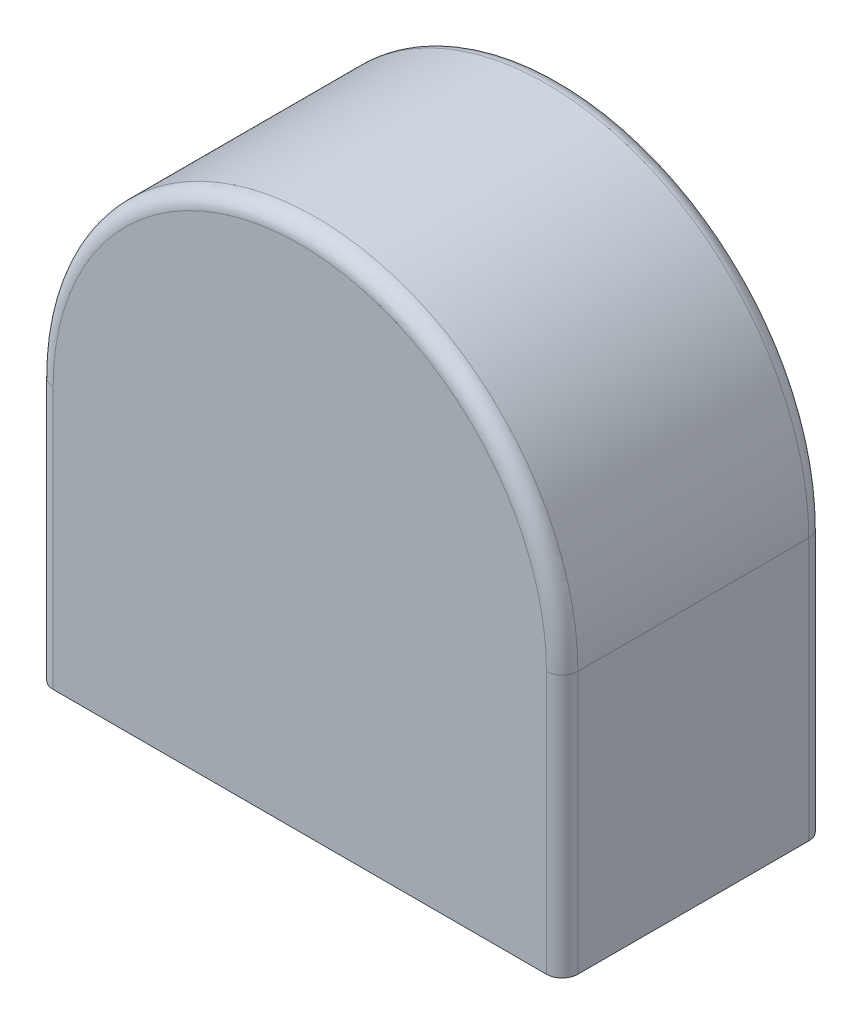
ISO-10303-21;
HEADER;
FILE_DESCRIPTION(('STEP AP214'),'2;1');
FILE_NAME('part.step','',(''),(''),'','','');
FILE_SCHEMA(('AUTOMOTIVE_DESIGN { 1 0 10303 214 1 1 1 1 }'));
ENDSEC;
DATA;
#1=APPLICATION_CONTEXT('core data for automotive mechanical design processes');
#2=APPLICATION_PROTOCOL_DEFINITION('international standard','automotive_design',2000,#1);
#3=PRODUCT_CONTEXT('',#1,'mechanical');
#4=PRODUCT('Part','Part','',(#3));
#5=PRODUCT_RELATED_PRODUCT_CATEGORY('part','',(#4));
#6=PRODUCT_DEFINITION_FORMATION('','',#4);
#7=PRODUCT_DEFINITION_CONTEXT('part definition',#1,'design');
#8=PRODUCT_DEFINITION('design','',#6,#7);
#9=PRODUCT_DEFINITION_SHAPE('','',#8);
#10=(LENGTH_UNIT() NAMED_UNIT(*) SI_UNIT(.MILLI.,.METRE.));
#11=(NAMED_UNIT(*) PLANE_ANGLE_UNIT() SI_UNIT($,.RADIAN.));
#12=(NAMED_UNIT(*) SI_UNIT($,.STERADIAN.) SOLID_ANGLE_UNIT());
#13=UNCERTAINTY_MEASURE_WITH_UNIT(LENGTH_MEASURE(1.E-05),#10,'distance_accuracy_value','');
#14=(GEOMETRIC_REPRESENTATION_CONTEXT(3) GLOBAL_UNCERTAINTY_ASSIGNED_CONTEXT((#13)) GLOBAL_UNIT_ASSIGNED_CONTEXT((#10,
#11,#12)) REPRESENTATION_CONTEXT('',''));
#15=CARTESIAN_POINT('',(0.,0.,0.));
#16=DIRECTION('',(0.,0.,1.));
#17=DIRECTION('',(1.,0.,0.));
#18=AXIS2_PLACEMENT_3D('',#15,#16,#17);
#19=CARTESIAN_POINT('',(0.,50.,25.));
#20=DIRECTION('',(0.,0.,1.));
#21=DIRECTION('',(1.,0.,0.));
#22=AXIS2_PLACEMENT_3D('',#19,#20,#21);
#23=CYLINDRICAL_SURFACE('',#22,50.);
#24=DIRECTION('',(0.,0.,1.));
#25=VECTOR('',#24,1.);
#26=CARTESIAN_POINT('',(50.,50.,25.));
#27=LINE('',#26,#25);
#28=CARTESIAN_POINT('',(50.,50.,-22.));
#29=VERTEX_POINT('',#28);
#30=CARTESIAN_POINT('',(50.,50.,22.));
#31=VERTEX_POINT('',#30);
#32=EDGE_CURVE('E141',#29,#31,#27,.T.);
#33=ORIENTED_EDGE('',*,*,#32,.F.);
#34=CARTESIAN_POINT('',(0.,50.,-22.));
#35=DIRECTION('',(0.,0.,1.));
#36=DIRECTION('',(1.,0.,0.));
#37=AXIS2_PLACEMENT_3D('',#34,#35,#36);
#38=CIRCLE('',#37,50.);
#39=CARTESIAN_POINT('',(-50.,50.,-22.));
#40=VERTEX_POINT('',#39);
#41=EDGE_CURVE('E155',#29,#40,#38,.T.);
#42=ORIENTED_EDGE('',*,*,#41,.T.);
#43=DIRECTION('',(0.,0.,1.));
#44=VECTOR('',#43,1.);
#45=CARTESIAN_POINT('',(-50.,50.,25.));
#46=LINE('',#45,#44);
#47=CARTESIAN_POINT('',(-50.,50.,22.));
#48=VERTEX_POINT('',#47);
#49=EDGE_CURVE('E138',#48,#40,#46,.F.);
#50=ORIENTED_EDGE('',*,*,#49,.F.);
#51=CARTESIAN_POINT('',(0.,50.,22.));
#52=DIRECTION('',(0.,0.,-1.));
#53=DIRECTION('',(-1.,0.,0.));
#54=AXIS2_PLACEMENT_3D('',#51,#52,#53);
#55=CIRCLE('',#54,50.);
#56=EDGE_CURVE('E153',#48,#31,#55,.T.);
#57=ORIENTED_EDGE('',*,*,#56,.T.);
#58=EDGE_LOOP('',(#33,#42,#50,#57));
#59=FACE_BOUND('',#58,.T.);
#60=ADVANCED_FACE('F36',(#59),#23,.T.);
#61=CARTESIAN_POINT('',(50.,100.,25.));
#62=DIRECTION('',(-1.,0.,0.));
#63=DIRECTION('',(0.,0.,1.));
#64=AXIS2_PLACEMENT_3D('',#61,#62,#63);
#65=PLANE('',#64);
#66=DIRECTION('',(0.,0.,-1.));
#67=VECTOR('',#66,1.);
#68=CARTESIAN_POINT('',(50.,0.,25.));
#69=LINE('',#68,#67);
#70=CARTESIAN_POINT('',(50.,0.,22.));
#71=VERTEX_POINT('',#70);
#72=CARTESIAN_POINT('',(50.,0.,-22.));
#73=VERTEX_POINT('',#72);
#74=EDGE_CURVE('E129',#71,#73,#69,.T.);
#75=ORIENTED_EDGE('',*,*,#74,.T.);
#76=DIRECTION('',(0.,-1.,0.));
#77=VECTOR('',#76,1.);
#78=CARTESIAN_POINT('',(50.,100.,-22.));
#79=LINE('',#78,#77);
#80=EDGE_CURVE('E106',#73,#29,#79,.F.);
#81=ORIENTED_EDGE('',*,*,#80,.T.);
#82=ORIENTED_EDGE('',*,*,#32,.T.);
#83=DIRECTION('',(0.,-1.,0.));
#84=VECTOR('',#83,1.);
#85=CARTESIAN_POINT('',(50.,100.,22.));
#86=LINE('',#85,#84);
#87=EDGE_CURVE('E111',#31,#71,#86,.T.);
#88=ORIENTED_EDGE('',*,*,#87,.T.);
#89=EDGE_LOOP('',(#75,#81,#82,#88));
#90=FACE_BOUND('',#89,.T.);
#91=ADVANCED_FACE('F182',(#90),#65,.F.);
#92=CARTESIAN_POINT('',(-50.,100.,-25.));
#93=DIRECTION('',(0.,0.,1.));
#94=DIRECTION('',(1.,0.,0.));
#95=AXIS2_PLACEMENT_3D('',#92,#93,#94);
#96=PLANE('',#95);
#97=CARTESIAN_POINT('',(0.,50.,-25.));
#98=DIRECTION('',(0.,0.,1.));
#99=DIRECTION('',(1.,0.,0.));
#100=AXIS2_PLACEMENT_3D('',#97,#98,#99);
#101=CIRCLE('',#100,47.);
#102=CARTESIAN_POINT('',(-47.,50.,-25.));
#103=VERTEX_POINT('',#102);
#104=CARTESIAN_POINT('',(47.,50.,-25.));
#105=VERTEX_POINT('',#104);
#106=EDGE_CURVE('E120',#103,#105,#101,.F.);
#107=ORIENTED_EDGE('',*,*,#106,.T.);
#108=DIRECTION('',(0.,-1.,0.));
#109=VECTOR('',#108,1.);
#110=CARTESIAN_POINT('',(47.,100.,-25.));
#111=LINE('',#110,#109);
#112=CARTESIAN_POINT('',(47.,0.,-25.));
#113=VERTEX_POINT('',#112);
#114=EDGE_CURVE('E105',#105,#113,#111,.T.);
#115=ORIENTED_EDGE('',*,*,#114,.T.);
#116=DIRECTION('',(-1.,0.,0.));
#117=VECTOR('',#116,1.);
#118=CARTESIAN_POINT('',(-50.,0.,-25.));
#119=LINE('',#118,#117);
#120=CARTESIAN_POINT('',(-47.,0.,-25.));
#121=VERTEX_POINT('',#120);
#122=EDGE_CURVE('E117',#113,#121,#119,.T.);
#123=ORIENTED_EDGE('',*,*,#122,.T.);
#124=DIRECTION('',(0.,-1.,0.));
#125=VECTOR('',#124,1.);
#126=CARTESIAN_POINT('',(-47.,100.,-25.));
#127=LINE('',#126,#125);
#128=EDGE_CURVE('E144',#121,#103,#127,.F.);
#129=ORIENTED_EDGE('',*,*,#128,.T.);
#130=EDGE_LOOP('',(#107,#115,#123,#129));
#131=FACE_BOUND('',#130,.T.);
#132=ADVANCED_FACE('F116',(#131),#96,.F.);
#133=CARTESIAN_POINT('',(-50.,100.,25.));
#134=DIRECTION('',(1.,0.,0.));
#135=DIRECTION('',(0.,0.,-1.));
#136=AXIS2_PLACEMENT_3D('',#133,#134,#135);
#137=PLANE('',#136);
#138=ORIENTED_EDGE('',*,*,#49,.T.);
#139=DIRECTION('',(0.,-1.,0.));
#140=VECTOR('',#139,1.);
#141=CARTESIAN_POINT('',(-50.,100.,-22.));
#142=LINE('',#141,#140);
#143=CARTESIAN_POINT('',(-50.,0.,-22.));
#144=VERTEX_POINT('',#143);
#145=EDGE_CURVE('E11',#40,#144,#142,.T.);
#146=ORIENTED_EDGE('',*,*,#145,.T.);
#147=DIRECTION('',(0.,0.,1.));
#148=VECTOR('',#147,1.);
#149=CARTESIAN_POINT('',(-50.,0.,25.));
#150=LINE('',#149,#148);
#151=CARTESIAN_POINT('',(-50.,0.,22.));
#152=VERTEX_POINT('',#151);
#153=EDGE_CURVE('E128',#144,#152,#150,.T.);
#154=ORIENTED_EDGE('',*,*,#153,.T.);
#155=DIRECTION('',(0.,-1.,0.));
#156=VECTOR('',#155,1.);
#157=CARTESIAN_POINT('',(-50.,100.,22.));
#158=LINE('',#157,#156);
#159=EDGE_CURVE('E45',#152,#48,#158,.F.);
#160=ORIENTED_EDGE('',*,*,#159,.T.);
#161=EDGE_LOOP('',(#138,#146,#154,#160));
#162=FACE_BOUND('',#161,.T.);
#163=ADVANCED_FACE('F194',(#162),#137,.F.);
#164=CARTESIAN_POINT('',(-50.,100.,25.));
#165=DIRECTION('',(0.,0.,-1.));
#166=DIRECTION('',(-1.,0.,0.));
#167=AXIS2_PLACEMENT_3D('',#164,#165,#166);
#168=PLANE('',#167);
#169=DIRECTION('',(1.,0.,0.));
#170=VECTOR('',#169,1.);
#171=CARTESIAN_POINT('',(-50.,0.,25.));
#172=LINE('',#171,#170);
#173=CARTESIAN_POINT('',(-47.,0.,25.));
#174=VERTEX_POINT('',#173);
#175=CARTESIAN_POINT('',(47.,0.,25.));
#176=VERTEX_POINT('',#175);
#177=EDGE_CURVE('E132',#174,#176,#172,.T.);
#178=ORIENTED_EDGE('',*,*,#177,.T.);
#179=DIRECTION('',(0.,-1.,0.));
#180=VECTOR('',#179,1.);
#181=CARTESIAN_POINT('',(47.,100.,25.));
#182=LINE('',#181,#180);
#183=CARTESIAN_POINT('',(47.,50.,25.));
#184=VERTEX_POINT('',#183);
#185=EDGE_CURVE('E53',#176,#184,#182,.F.);
#186=ORIENTED_EDGE('',*,*,#185,.T.);
#187=CARTESIAN_POINT('',(0.,50.,25.));
#188=DIRECTION('',(0.,0.,-1.));
#189=DIRECTION('',(-1.,0.,0.));
#190=AXIS2_PLACEMENT_3D('',#187,#188,#189);
#191=CIRCLE('',#190,47.);
#192=CARTESIAN_POINT('',(-47.,50.,25.));
#193=VERTEX_POINT('',#192);
#194=EDGE_CURVE('E57',#184,#193,#191,.F.);
#195=ORIENTED_EDGE('',*,*,#194,.T.);
#196=DIRECTION('',(0.,-1.,0.));
#197=VECTOR('',#196,1.);
#198=CARTESIAN_POINT('',(-47.,100.,25.));
#199=LINE('',#198,#197);
#200=EDGE_CURVE('E157',#193,#174,#199,.T.);
#201=ORIENTED_EDGE('',*,*,#200,.T.);
#202=EDGE_LOOP('',(#178,#186,#195,#201));
#203=FACE_BOUND('',#202,.T.);
#204=ADVANCED_FACE('F179',(#203),#168,.F.);
#205=CARTESIAN_POINT('',(0.,0.,0.));
#206=DIRECTION('',(0.,-1.,0.));
#207=DIRECTION('',(0.,0.,-1.));
#208=AXIS2_PLACEMENT_3D('',#205,#206,#207);
#209=PLANE('',#208);
#210=ORIENTED_EDGE('',*,*,#122,.F.);
#211=CARTESIAN_POINT('',(47.,0.,-22.));
#212=DIRECTION('',(0.,-1.,0.));
#213=DIRECTION('',(0.,0.,-1.));
#214=AXIS2_PLACEMENT_3D('',#211,#212,#213);
#215=CIRCLE('',#214,3.);
#216=EDGE_CURVE('E101',#113,#73,#215,.T.);
#217=ORIENTED_EDGE('',*,*,#216,.T.);
#218=ORIENTED_EDGE('',*,*,#74,.F.);
#219=CARTESIAN_POINT('',(47.,0.,22.));
#220=DIRECTION('',(0.,-1.,0.));
#221=DIRECTION('',(0.,0.,-1.));
#222=AXIS2_PLACEMENT_3D('',#219,#220,#221);
#223=CIRCLE('',#222,3.);
#224=EDGE_CURVE('E112',#71,#176,#223,.T.);
#225=ORIENTED_EDGE('',*,*,#224,.T.);
#226=ORIENTED_EDGE('',*,*,#177,.F.);
#227=CARTESIAN_POINT('',(-47.,0.,22.));
#228=DIRECTION('',(0.,-1.,0.));
#229=DIRECTION('',(0.,0.,-1.));
#230=AXIS2_PLACEMENT_3D('',#227,#228,#229);
#231=CIRCLE('',#230,3.);
#232=EDGE_CURVE('E122',#174,#152,#231,.T.);
#233=ORIENTED_EDGE('',*,*,#232,.T.);
#234=ORIENTED_EDGE('',*,*,#153,.F.);
#235=CARTESIAN_POINT('',(-47.,0.,-22.));
#236=DIRECTION('',(0.,-1.,0.));
#237=DIRECTION('',(0.,0.,-1.));
#238=AXIS2_PLACEMENT_3D('',#235,#236,#237);
#239=CIRCLE('',#238,3.);
#240=EDGE_CURVE('E127',#144,#121,#239,.T.);
#241=ORIENTED_EDGE('',*,*,#240,.T.);
#242=EDGE_LOOP('',(#210,#217,#218,#225,#226,#233,#234,#241));
#243=FACE_BOUND('',#242,.T.);
#244=ADVANCED_FACE('F124',(#243),#209,.T.);
#245=CARTESIAN_POINT('',(-47.,100.,-22.));
#246=DIRECTION('',(0.,-1.,0.));
#247=DIRECTION('',(0.,0.,-1.));
#248=AXIS2_PLACEMENT_3D('',#245,#246,#247);
#249=CYLINDRICAL_SURFACE('',#248,3.);
#250=ORIENTED_EDGE('',*,*,#240,.F.);
#251=ORIENTED_EDGE('',*,*,#145,.F.);
#252=CARTESIAN_POINT('',(-47.,50.,-22.));
#253=DIRECTION('',(0.,1.,0.));
#254=DIRECTION('',(0.,0.,1.));
#255=AXIS2_PLACEMENT_3D('',#252,#253,#254);
#256=CIRCLE('',#255,3.);
#257=EDGE_CURVE('E134',#103,#40,#256,.T.);
#258=ORIENTED_EDGE('',*,*,#257,.F.);
#259=ORIENTED_EDGE('',*,*,#128,.F.);
#260=EDGE_LOOP('',(#250,#251,#258,#259));
#261=FACE_BOUND('',#260,.T.);
#262=ADVANCED_FACE('F192',(#261),#249,.T.);
#263=CARTESIAN_POINT('',(0.,50.,-22.));
#264=DIRECTION('',(0.,0.,1.));
#265=DIRECTION('',(1.,0.,0.));
#266=AXIS2_PLACEMENT_3D('',#263,#264,#265);
#267=TOROIDAL_SURFACE('',#266,47.,3.);
#268=ORIENTED_EDGE('',*,*,#257,.T.);
#269=ORIENTED_EDGE('',*,*,#41,.F.);
#270=CARTESIAN_POINT('',(47.,50.,-22.));
#271=DIRECTION('',(0.,-1.,0.));
#272=DIRECTION('',(0.,0.,-1.));
#273=AXIS2_PLACEMENT_3D('',#270,#271,#272);
#274=CIRCLE('',#273,3.);
#275=EDGE_CURVE('E162',#105,#29,#274,.T.);
#276=ORIENTED_EDGE('',*,*,#275,.F.);
#277=ORIENTED_EDGE('',*,*,#106,.F.);
#278=EDGE_LOOP('',(#268,#269,#276,#277));
#279=FACE_BOUND('',#278,.T.);
#280=ADVANCED_FACE('F188',(#279),#267,.T.);
#281=CARTESIAN_POINT('',(47.,100.,-22.));
#282=DIRECTION('',(0.,-1.,0.));
#283=DIRECTION('',(0.,0.,-1.));
#284=AXIS2_PLACEMENT_3D('',#281,#282,#283);
#285=CYLINDRICAL_SURFACE('',#284,3.);
#286=ORIENTED_EDGE('',*,*,#275,.T.);
#287=ORIENTED_EDGE('',*,*,#80,.F.);
#288=ORIENTED_EDGE('',*,*,#216,.F.);
#289=ORIENTED_EDGE('',*,*,#114,.F.);
#290=EDGE_LOOP('',(#286,#287,#288,#289));
#291=FACE_BOUND('',#290,.T.);
#292=ADVANCED_FACE('F104',(#291),#285,.T.);
#293=CARTESIAN_POINT('',(-47.,100.,22.));
#294=DIRECTION('',(0.,-1.,0.));
#295=DIRECTION('',(0.,0.,-1.));
#296=AXIS2_PLACEMENT_3D('',#293,#294,#295);
#297=CYLINDRICAL_SURFACE('',#296,3.);
#298=ORIENTED_EDGE('',*,*,#232,.F.);
#299=ORIENTED_EDGE('',*,*,#200,.F.);
#300=CARTESIAN_POINT('',(-47.,50.,22.));
#301=DIRECTION('',(0.,1.,0.));
#302=DIRECTION('',(0.,0.,1.));
#303=AXIS2_PLACEMENT_3D('',#300,#301,#302);
#304=CIRCLE('',#303,3.);
#305=EDGE_CURVE('E40',#48,#193,#304,.T.);
#306=ORIENTED_EDGE('',*,*,#305,.F.);
#307=ORIENTED_EDGE('',*,*,#159,.F.);
#308=EDGE_LOOP('',(#298,#299,#306,#307));
#309=FACE_BOUND('',#308,.T.);
#310=ADVANCED_FACE('F38',(#309),#297,.T.);
#311=CARTESIAN_POINT('',(0.,50.,22.));
#312=DIRECTION('',(0.,0.,-1.));
#313=DIRECTION('',(-1.,0.,0.));
#314=AXIS2_PLACEMENT_3D('',#311,#312,#313);
#315=TOROIDAL_SURFACE('',#314,47.,3.);
#316=ORIENTED_EDGE('',*,*,#305,.T.);
#317=ORIENTED_EDGE('',*,*,#194,.F.);
#318=CARTESIAN_POINT('',(47.,50.,22.));
#319=DIRECTION('',(0.,-1.,0.));
#320=DIRECTION('',(0.,0.,-1.));
#321=AXIS2_PLACEMENT_3D('',#318,#319,#320);
#322=CIRCLE('',#321,3.);
#323=EDGE_CURVE('E165',#31,#184,#322,.T.);
#324=ORIENTED_EDGE('',*,*,#323,.F.);
#325=ORIENTED_EDGE('',*,*,#56,.F.);
#326=EDGE_LOOP('',(#316,#317,#324,#325));
#327=FACE_BOUND('',#326,.T.);
#328=ADVANCED_FACE('F174',(#327),#315,.T.);
#329=CARTESIAN_POINT('',(47.,100.,22.));
#330=DIRECTION('',(0.,-1.,0.));
#331=DIRECTION('',(0.,0.,-1.));
#332=AXIS2_PLACEMENT_3D('',#329,#330,#331);
#333=CYLINDRICAL_SURFACE('',#332,3.);
#334=ORIENTED_EDGE('',*,*,#323,.T.);
#335=ORIENTED_EDGE('',*,*,#185,.F.);
#336=ORIENTED_EDGE('',*,*,#224,.F.);
#337=ORIENTED_EDGE('',*,*,#87,.F.);
#338=EDGE_LOOP('',(#334,#335,#336,#337));
#339=FACE_BOUND('',#338,.T.);
#340=ADVANCED_FACE('F180',(#339),#333,.T.);
#341=CLOSED_SHELL('',(#60,#91,#132,#163,#204,#244,#262,#280,#292,#310,#328,#340));
#342=MANIFOLD_SOLID_BREP('B2',#341);
#343=ADVANCED_BREP_SHAPE_REPRESENTATION('',(#18,#342),#14);
#344=SHAPE_DEFINITION_REPRESENTATION(#9,#343);
ENDSEC;
END-ISO-10303-21;
